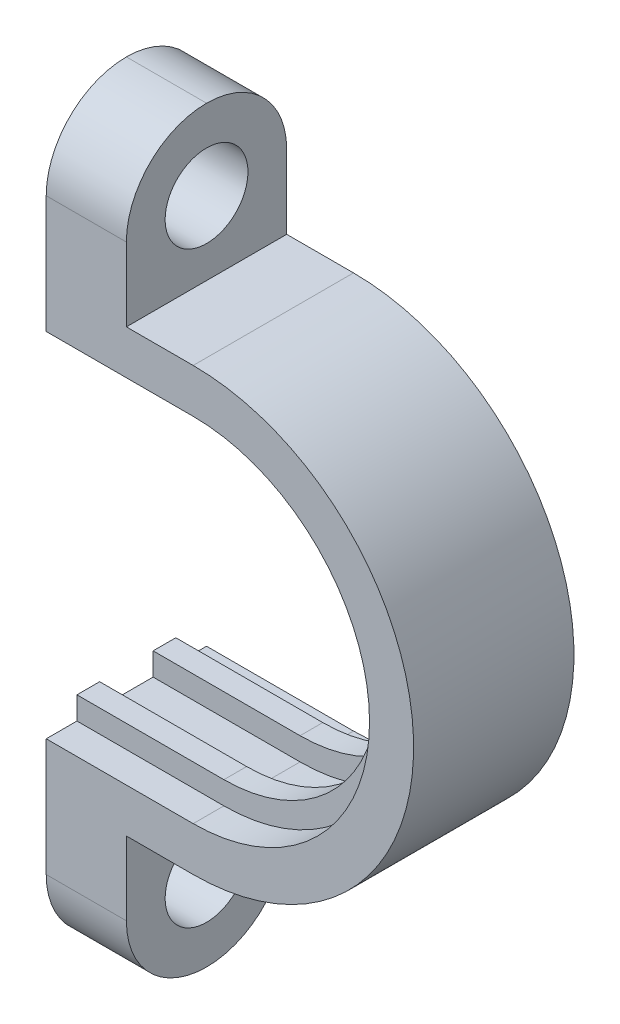
ISO-10303-21;
HEADER;
FILE_DESCRIPTION(('STEP AP214'),'2;1');
FILE_NAME('part.step','',(''),(''),'','','');
FILE_SCHEMA(('AUTOMOTIVE_DESIGN { 1 0 10303 214 1 1 1 1 }'));
ENDSEC;
DATA;
#1=APPLICATION_CONTEXT('core data for automotive mechanical design processes');
#2=APPLICATION_PROTOCOL_DEFINITION('international standard','automotive_design',2000,#1);
#3=PRODUCT_CONTEXT('',#1,'mechanical');
#4=PRODUCT('Part','Part','',(#3));
#5=PRODUCT_RELATED_PRODUCT_CATEGORY('part','',(#4));
#6=PRODUCT_DEFINITION_FORMATION('','',#4);
#7=PRODUCT_DEFINITION_CONTEXT('part definition',#1,'design');
#8=PRODUCT_DEFINITION('design','',#6,#7);
#9=PRODUCT_DEFINITION_SHAPE('','',#8);
#10=(LENGTH_UNIT() NAMED_UNIT(*) SI_UNIT(.MILLI.,.METRE.));
#11=(NAMED_UNIT(*) PLANE_ANGLE_UNIT() SI_UNIT($,.RADIAN.));
#12=(NAMED_UNIT(*) SI_UNIT($,.STERADIAN.) SOLID_ANGLE_UNIT());
#13=UNCERTAINTY_MEASURE_WITH_UNIT(LENGTH_MEASURE(1.E-05),#10,'distance_accuracy_value','');
#14=(GEOMETRIC_REPRESENTATION_CONTEXT(3) GLOBAL_UNCERTAINTY_ASSIGNED_CONTEXT((#13)) GLOBAL_UNIT_ASSIGNED_CONTEXT((#10,
#11,#12)) REPRESENTATION_CONTEXT('',''));
#15=CARTESIAN_POINT('',(0.,0.,0.));
#16=DIRECTION('',(0.,0.,1.));
#17=DIRECTION('',(1.,0.,0.));
#18=AXIS2_PLACEMENT_3D('',#15,#16,#17);
#19=CARTESIAN_POINT('',(0.,0.,6.));
#20=DIRECTION('',(0.,0.,-1.));
#21=DIRECTION('',(-1.,0.,0.));
#22=AXIS2_PLACEMENT_3D('',#19,#20,#21);
#23=CYLINDRICAL_SURFACE('',#22,5.75);
#24=CARTESIAN_POINT('',(0.,0.,4.85));
#25=DIRECTION('',(0.,0.,-1.));
#26=DIRECTION('',(0.,1.,0.));
#27=AXIS2_PLACEMENT_3D('',#24,#25,#26);
#28=CIRCLE('',#27,5.75000000000001);
#29=CARTESIAN_POINT('',(0.,5.75,4.85));
#30=VERTEX_POINT('',#29);
#31=CARTESIAN_POINT('',(0.,-5.75,4.85));
#32=VERTEX_POINT('',#31);
#33=EDGE_CURVE('E469',#30,#32,#28,.T.);
#34=ORIENTED_EDGE('',*,*,#33,.F.);
#35=DIRECTION('',(0.,0.,-1.));
#36=VECTOR('',#35,1.);
#37=CARTESIAN_POINT('',(0.,5.75,6.));
#38=LINE('',#37,#36);
#39=CARTESIAN_POINT('',(0.,5.75,4.));
#40=VERTEX_POINT('',#39);
#41=EDGE_CURVE('E404',#30,#40,#38,.T.);
#42=ORIENTED_EDGE('',*,*,#41,.T.);
#43=CARTESIAN_POINT('',(0.,0.,4.));
#44=DIRECTION('',(0.,0.,-1.));
#45=DIRECTION('',(0.,1.,0.));
#46=AXIS2_PLACEMENT_3D('',#43,#44,#45);
#47=CIRCLE('',#46,5.75);
#48=CARTESIAN_POINT('',(0.,-5.75,4.));
#49=VERTEX_POINT('',#48);
#50=EDGE_CURVE('E246',#40,#49,#47,.T.);
#51=ORIENTED_EDGE('',*,*,#50,.T.);
#52=DIRECTION('',(0.,0.,-1.));
#53=VECTOR('',#52,1.);
#54=CARTESIAN_POINT('',(0.,-5.75,6.));
#55=LINE('',#54,#53);
#56=EDGE_CURVE('E400',#32,#49,#55,.T.);
#57=ORIENTED_EDGE('',*,*,#56,.F.);
#58=EDGE_LOOP('',(#34,#42,#51,#57));
#59=FACE_BOUND('',#58,.T.);
#60=ADVANCED_FACE('F39',(#59),#23,.F.);
#61=CARTESIAN_POINT('',(0.,0.,2.));
#62=DIRECTION('',(0.,0.,-1.));
#63=DIRECTION('',(0.,1.,0.));
#64=AXIS2_PLACEMENT_3D('',#61,#62,#63);
#65=CIRCLE('',#64,5.75);
#66=CARTESIAN_POINT('',(0.,5.75,2.));
#67=VERTEX_POINT('',#66);
#68=CARTESIAN_POINT('',(0.,-5.75,2.));
#69=VERTEX_POINT('',#68);
#70=EDGE_CURVE('E476',#67,#69,#65,.T.);
#71=ORIENTED_EDGE('',*,*,#70,.F.);
#72=CARTESIAN_POINT('',(0.,5.75,1.15));
#73=VERTEX_POINT('',#72);
#74=EDGE_CURVE('E401',#67,#73,#38,.T.);
#75=ORIENTED_EDGE('',*,*,#74,.T.);
#76=CARTESIAN_POINT('',(0.,0.,1.15));
#77=DIRECTION('',(0.,0.,-1.));
#78=DIRECTION('',(0.,1.,0.));
#79=AXIS2_PLACEMENT_3D('',#76,#77,#78);
#80=CIRCLE('',#79,5.75);
#81=CARTESIAN_POINT('',(0.,-5.75,1.15));
#82=VERTEX_POINT('',#81);
#83=EDGE_CURVE('E481',#73,#82,#80,.T.);
#84=ORIENTED_EDGE('',*,*,#83,.T.);
#85=EDGE_CURVE('E397',#69,#82,#55,.T.);
#86=ORIENTED_EDGE('',*,*,#85,.F.);
#87=EDGE_LOOP('',(#71,#75,#84,#86));
#88=FACE_BOUND('',#87,.T.);
#89=ADVANCED_FACE('F497',(#88),#23,.F.);
#90=CARTESIAN_POINT('',(0.,0.,6.));
#91=DIRECTION('',(0.,0.,-1.));
#92=DIRECTION('',(-1.,0.,0.));
#93=AXIS2_PLACEMENT_3D('',#90,#91,#92);
#94=PLANE('',#93);
#95=CARTESIAN_POINT('',(0.,0.,6.));
#96=DIRECTION('',(0.,0.,-1.));
#97=DIRECTION('',(0.,1.,0.));
#98=AXIS2_PLACEMENT_3D('',#95,#96,#97);
#99=CIRCLE('',#98,6.6);
#100=CARTESIAN_POINT('',(0.,6.6,6.));
#101=VERTEX_POINT('',#100);
#102=CARTESIAN_POINT('',(0.,-6.6,6.));
#103=VERTEX_POINT('',#102);
#104=EDGE_CURVE('E318',#101,#103,#99,.T.);
#105=ORIENTED_EDGE('',*,*,#104,.T.);
#106=DIRECTION('',(-1.,0.,0.));
#107=VECTOR('',#106,1.);
#108=CARTESIAN_POINT('',(0.,-6.6,6.));
#109=LINE('',#108,#107);
#110=CARTESIAN_POINT('',(-5.5,-6.6,6.));
#111=VERTEX_POINT('',#110);
#112=EDGE_CURVE('E11',#103,#111,#109,.T.);
#113=ORIENTED_EDGE('',*,*,#112,.T.);
#114=DIRECTION('',(0.,-1.,0.));
#115=VECTOR('',#114,1.);
#116=CARTESIAN_POINT('',(-5.5,-5.75,6.));
#117=LINE('',#116,#115);
#118=CARTESIAN_POINT('',(-5.5,-11.,6.));
#119=VERTEX_POINT('',#118);
#120=EDGE_CURVE('E354',#111,#119,#117,.T.);
#121=ORIENTED_EDGE('',*,*,#120,.T.);
#122=DIRECTION('',(1.,0.,0.));
#123=VECTOR('',#122,1.);
#124=CARTESIAN_POINT('',(0.,-11.,6.));
#125=LINE('',#124,#123);
#126=CARTESIAN_POINT('',(-2.5,-11.,6.));
#127=VERTEX_POINT('',#126);
#128=EDGE_CURVE('E426',#119,#127,#125,.T.);
#129=ORIENTED_EDGE('',*,*,#128,.T.);
#130=DIRECTION('',(0.,1.,0.));
#131=VECTOR('',#130,1.);
#132=CARTESIAN_POINT('',(-2.5,-8.25,6.));
#133=LINE('',#132,#131);
#134=CARTESIAN_POINT('',(-2.5,-8.25,6.));
#135=VERTEX_POINT('',#134);
#136=EDGE_CURVE('E357',#127,#135,#133,.T.);
#137=ORIENTED_EDGE('',*,*,#136,.T.);
#138=DIRECTION('',(1.,0.,0.));
#139=VECTOR('',#138,1.);
#140=CARTESIAN_POINT('',(-2.5,-8.25,6.));
#141=LINE('',#140,#139);
#142=CARTESIAN_POINT('',(0.,-8.25,6.));
#143=VERTEX_POINT('',#142);
#144=EDGE_CURVE('E359',#135,#143,#141,.T.);
#145=ORIENTED_EDGE('',*,*,#144,.T.);
#146=CARTESIAN_POINT('',(0.,0.,6.));
#147=DIRECTION('',(0.,0.,1.));
#148=DIRECTION('',(1.,0.,0.));
#149=AXIS2_PLACEMENT_3D('',#146,#147,#148);
#150=CIRCLE('',#149,8.25);
#151=CARTESIAN_POINT('',(0.,8.25,6.));
#152=VERTEX_POINT('',#151);
#153=EDGE_CURVE('E361',#143,#152,#150,.T.);
#154=ORIENTED_EDGE('',*,*,#153,.T.);
#155=DIRECTION('',(-1.,0.,0.));
#156=VECTOR('',#155,1.);
#157=CARTESIAN_POINT('',(-2.5,8.25,6.));
#158=LINE('',#157,#156);
#159=CARTESIAN_POINT('',(-2.5,8.25,6.));
#160=VERTEX_POINT('',#159);
#161=EDGE_CURVE('E363',#152,#160,#158,.T.);
#162=ORIENTED_EDGE('',*,*,#161,.T.);
#163=DIRECTION('',(0.,1.,0.));
#164=VECTOR('',#163,1.);
#165=CARTESIAN_POINT('',(-2.5,14.,6.));
#166=LINE('',#165,#164);
#167=CARTESIAN_POINT('',(-2.5,11.,6.));
#168=VERTEX_POINT('',#167);
#169=EDGE_CURVE('E365',#160,#168,#166,.T.);
#170=ORIENTED_EDGE('',*,*,#169,.T.);
#171=DIRECTION('',(-1.,0.,0.));
#172=VECTOR('',#171,1.);
#173=CARTESIAN_POINT('',(0.,11.,6.));
#174=LINE('',#173,#172);
#175=CARTESIAN_POINT('',(-5.5,11.,6.));
#176=VERTEX_POINT('',#175);
#177=EDGE_CURVE('E424',#168,#176,#174,.T.);
#178=ORIENTED_EDGE('',*,*,#177,.T.);
#179=DIRECTION('',(0.,-1.,0.));
#180=VECTOR('',#179,1.);
#181=CARTESIAN_POINT('',(-5.5,14.,6.));
#182=LINE('',#181,#180);
#183=CARTESIAN_POINT('',(-5.5,6.6,6.));
#184=VERTEX_POINT('',#183);
#185=EDGE_CURVE('E351',#176,#184,#182,.T.);
#186=ORIENTED_EDGE('',*,*,#185,.T.);
#187=DIRECTION('',(1.,0.,0.));
#188=VECTOR('',#187,1.);
#189=CARTESIAN_POINT('',(0.,6.6,6.));
#190=LINE('',#189,#188);
#191=EDGE_CURVE('E47',#184,#101,#190,.T.);
#192=ORIENTED_EDGE('',*,*,#191,.T.);
#193=EDGE_LOOP('',(#105,#113,#121,#129,#137,#145,#154,#162,#170,#178,#186,#192));
#194=FACE_BOUND('',#193,.T.);
#195=ADVANCED_FACE('F446',(#194),#94,.F.);
#196=CARTESIAN_POINT('',(0.,0.,0.));
#197=DIRECTION('',(0.,0.,-1.));
#198=DIRECTION('',(-1.,0.,0.));
#199=AXIS2_PLACEMENT_3D('',#196,#197,#198);
#200=PLANE('',#199);
#201=DIRECTION('',(-1.,0.,0.));
#202=VECTOR('',#201,1.);
#203=CARTESIAN_POINT('',(0.,-6.6,0.));
#204=LINE('',#203,#202);
#205=CARTESIAN_POINT('',(0.,-6.6,0.));
#206=VERTEX_POINT('',#205);
#207=CARTESIAN_POINT('',(-5.5,-6.6,0.));
#208=VERTEX_POINT('',#207);
#209=EDGE_CURVE('E442',#206,#208,#204,.T.);
#210=ORIENTED_EDGE('',*,*,#209,.F.);
#211=CARTESIAN_POINT('',(0.,0.,0.));
#212=DIRECTION('',(0.,0.,-1.));
#213=DIRECTION('',(0.,1.,0.));
#214=AXIS2_PLACEMENT_3D('',#211,#212,#213);
#215=CIRCLE('',#214,6.6);
#216=CARTESIAN_POINT('',(0.,6.6,0.));
#217=VERTEX_POINT('',#216);
#218=EDGE_CURVE('E247',#217,#206,#215,.T.);
#219=ORIENTED_EDGE('',*,*,#218,.F.);
#220=DIRECTION('',(1.,0.,0.));
#221=VECTOR('',#220,1.);
#222=CARTESIAN_POINT('',(0.,6.6,0.));
#223=LINE('',#222,#221);
#224=CARTESIAN_POINT('',(-5.5,6.6,0.));
#225=VERTEX_POINT('',#224);
#226=EDGE_CURVE('E435',#225,#217,#223,.T.);
#227=ORIENTED_EDGE('',*,*,#226,.F.);
#228=DIRECTION('',(0.,-1.,0.));
#229=VECTOR('',#228,1.);
#230=CARTESIAN_POINT('',(-5.5,14.,0.));
#231=LINE('',#230,#229);
#232=CARTESIAN_POINT('',(-5.5,11.,0.));
#233=VERTEX_POINT('',#232);
#234=EDGE_CURVE('E350',#233,#225,#231,.T.);
#235=ORIENTED_EDGE('',*,*,#234,.F.);
#236=DIRECTION('',(-1.,0.,0.));
#237=VECTOR('',#236,1.);
#238=CARTESIAN_POINT('',(-2.5,11.,0.));
#239=LINE('',#238,#237);
#240=CARTESIAN_POINT('',(-2.5,11.,0.));
#241=VERTEX_POINT('',#240);
#242=EDGE_CURVE('E413',#233,#241,#239,.F.);
#243=ORIENTED_EDGE('',*,*,#242,.T.);
#244=DIRECTION('',(0.,1.,0.));
#245=VECTOR('',#244,1.);
#246=CARTESIAN_POINT('',(-2.5,14.,0.));
#247=LINE('',#246,#245);
#248=CARTESIAN_POINT('',(-2.5,8.25,0.));
#249=VERTEX_POINT('',#248);
#250=EDGE_CURVE('E355',#249,#241,#247,.T.);
#251=ORIENTED_EDGE('',*,*,#250,.F.);
#252=DIRECTION('',(-1.,0.,0.));
#253=VECTOR('',#252,1.);
#254=CARTESIAN_POINT('',(-2.5,8.25,0.));
#255=LINE('',#254,#253);
#256=CARTESIAN_POINT('',(0.,8.25,0.));
#257=VERTEX_POINT('',#256);
#258=EDGE_CURVE('E379',#257,#249,#255,.T.);
#259=ORIENTED_EDGE('',*,*,#258,.F.);
#260=CARTESIAN_POINT('',(0.,0.,0.));
#261=DIRECTION('',(0.,0.,1.));
#262=DIRECTION('',(1.,0.,0.));
#263=AXIS2_PLACEMENT_3D('',#260,#261,#262);
#264=CIRCLE('',#263,8.25);
#265=CARTESIAN_POINT('',(0.,-8.25,0.));
#266=VERTEX_POINT('',#265);
#267=EDGE_CURVE('E377',#266,#257,#264,.T.);
#268=ORIENTED_EDGE('',*,*,#267,.F.);
#269=DIRECTION('',(1.,0.,0.));
#270=VECTOR('',#269,1.);
#271=CARTESIAN_POINT('',(-2.5,-8.25,0.));
#272=LINE('',#271,#270);
#273=CARTESIAN_POINT('',(-2.5,-8.25,0.));
#274=VERTEX_POINT('',#273);
#275=EDGE_CURVE('E375',#274,#266,#272,.T.);
#276=ORIENTED_EDGE('',*,*,#275,.F.);
#277=DIRECTION('',(0.,1.,0.));
#278=VECTOR('',#277,1.);
#279=CARTESIAN_POINT('',(-2.5,-8.25,0.));
#280=LINE('',#279,#278);
#281=CARTESIAN_POINT('',(-2.5,-11.,0.));
#282=VERTEX_POINT('',#281);
#283=EDGE_CURVE('E373',#282,#274,#280,.T.);
#284=ORIENTED_EDGE('',*,*,#283,.F.);
#285=DIRECTION('',(1.,0.,0.));
#286=VECTOR('',#285,1.);
#287=CARTESIAN_POINT('',(-5.5,-11.,0.));
#288=LINE('',#287,#286);
#289=CARTESIAN_POINT('',(-5.5,-11.,0.));
#290=VERTEX_POINT('',#289);
#291=EDGE_CURVE('E416',#282,#290,#288,.F.);
#292=ORIENTED_EDGE('',*,*,#291,.T.);
#293=DIRECTION('',(0.,-1.,0.));
#294=VECTOR('',#293,1.);
#295=CARTESIAN_POINT('',(-5.5,-5.75,0.));
#296=LINE('',#295,#294);
#297=EDGE_CURVE('E371',#208,#290,#296,.T.);
#298=ORIENTED_EDGE('',*,*,#297,.F.);
#299=EDGE_LOOP('',(#210,#219,#227,#235,#243,#251,#259,#268,#276,#284,#292,#298));
#300=FACE_BOUND('',#299,.T.);
#301=ADVANCED_FACE('F537',(#300),#200,.T.);
#302=CARTESIAN_POINT('',(0.,5.75,6.));
#303=DIRECTION('',(0.,1.,0.));
#304=DIRECTION('',(-1.,0.,0.));
#305=AXIS2_PLACEMENT_3D('',#302,#303,#304);
#306=PLANE('',#305);
#307=ORIENTED_EDGE('',*,*,#74,.F.);
#308=DIRECTION('',(-1.,0.,0.));
#309=VECTOR('',#308,1.);
#310=CARTESIAN_POINT('',(0.,5.75,2.));
#311=LINE('',#310,#309);
#312=CARTESIAN_POINT('',(-5.5,5.75,2.));
#313=VERTEX_POINT('',#312);
#314=EDGE_CURVE('E264',#67,#313,#311,.T.);
#315=ORIENTED_EDGE('',*,*,#314,.T.);
#316=DIRECTION('',(0.,0.,-1.));
#317=VECTOR('',#316,1.);
#318=CARTESIAN_POINT('',(-5.5,5.75,6.));
#319=LINE('',#318,#317);
#320=CARTESIAN_POINT('',(-5.5,5.75,1.15));
#321=VERTEX_POINT('',#320);
#322=EDGE_CURVE('E405',#313,#321,#319,.T.);
#323=ORIENTED_EDGE('',*,*,#322,.T.);
#324=DIRECTION('',(-1.,0.,0.));
#325=VECTOR('',#324,1.);
#326=CARTESIAN_POINT('',(0.,5.75,1.15));
#327=LINE('',#326,#325);
#328=EDGE_CURVE('E327',#73,#321,#327,.T.);
#329=ORIENTED_EDGE('',*,*,#328,.F.);
#330=EDGE_LOOP('',(#307,#315,#323,#329));
#331=FACE_BOUND('',#330,.T.);
#332=ADVANCED_FACE('F495',(#331),#306,.F.);
#333=CARTESIAN_POINT('',(0.,-5.75,6.));
#334=DIRECTION('',(0.,-1.,0.));
#335=DIRECTION('',(1.,0.,0.));
#336=AXIS2_PLACEMENT_3D('',#333,#334,#335);
#337=PLANE('',#336);
#338=ORIENTED_EDGE('',*,*,#85,.T.);
#339=DIRECTION('',(-1.,0.,0.));
#340=VECTOR('',#339,1.);
#341=CARTESIAN_POINT('',(0.,-5.75,1.15));
#342=LINE('',#341,#340);
#343=CARTESIAN_POINT('',(-5.5,-5.75,1.15));
#344=VERTEX_POINT('',#343);
#345=EDGE_CURVE('E316',#82,#344,#342,.T.);
#346=ORIENTED_EDGE('',*,*,#345,.T.);
#347=DIRECTION('',(0.,0.,-1.));
#348=VECTOR('',#347,1.);
#349=CARTESIAN_POINT('',(-5.5,-5.75,6.));
#350=LINE('',#349,#348);
#351=CARTESIAN_POINT('',(-5.5,-5.75,2.));
#352=VERTEX_POINT('',#351);
#353=EDGE_CURVE('E393',#352,#344,#350,.T.);
#354=ORIENTED_EDGE('',*,*,#353,.F.);
#355=DIRECTION('',(-1.,0.,0.));
#356=VECTOR('',#355,1.);
#357=CARTESIAN_POINT('',(0.,-5.75,2.));
#358=LINE('',#357,#356);
#359=EDGE_CURVE('E301',#69,#352,#358,.T.);
#360=ORIENTED_EDGE('',*,*,#359,.F.);
#361=EDGE_LOOP('',(#338,#346,#354,#360));
#362=FACE_BOUND('',#361,.T.);
#363=ADVANCED_FACE('F503',(#362),#337,.F.);
#364=CARTESIAN_POINT('',(-5.5,14.,6.));
#365=DIRECTION('',(1.,0.,0.));
#366=DIRECTION('',(0.,1.,0.));
#367=AXIS2_PLACEMENT_3D('',#364,#365,#366);
#368=PLANE('',#367);
#369=CARTESIAN_POINT('',(-5.5,11.,3.));
#370=DIRECTION('',(1.,0.,0.));
#371=DIRECTION('',(0.,1.,0.));
#372=AXIS2_PLACEMENT_3D('',#369,#370,#371);
#373=CIRCLE('',#372,1.55);
#374=CARTESIAN_POINT('',(-5.5,12.55,3.));
#375=VERTEX_POINT('',#374);
#376=EDGE_CURVE('E340',#375,#375,#373,.T.);
#377=ORIENTED_EDGE('',*,*,#376,.T.);
#378=EDGE_LOOP('',(#377));
#379=FACE_BOUND('',#378,.T.);
#380=CARTESIAN_POINT('',(-5.5,5.75,4.85));
#381=VERTEX_POINT('',#380);
#382=CARTESIAN_POINT('',(-5.5,5.75,4.));
#383=VERTEX_POINT('',#382);
#384=EDGE_CURVE('E408',#381,#383,#319,.T.);
#385=ORIENTED_EDGE('',*,*,#384,.F.);
#386=DIRECTION('',(0.,-1.,0.));
#387=VECTOR('',#386,1.);
#388=CARTESIAN_POINT('',(-5.5,5.75,4.85));
#389=LINE('',#388,#387);
#390=CARTESIAN_POINT('',(-5.5,6.6,4.85));
#391=VERTEX_POINT('',#390);
#392=EDGE_CURVE('E281',#391,#381,#389,.T.);
#393=ORIENTED_EDGE('',*,*,#392,.F.);
#394=DIRECTION('',(0.,0.,-1.));
#395=VECTOR('',#394,1.);
#396=CARTESIAN_POINT('',(-5.5,6.6,4.85));
#397=LINE('',#396,#395);
#398=EDGE_CURVE('E279',#184,#391,#397,.T.);
#399=ORIENTED_EDGE('',*,*,#398,.F.);
#400=ORIENTED_EDGE('',*,*,#185,.F.);
#401=CARTESIAN_POINT('',(-5.5,11.,3.));
#402=DIRECTION('',(1.,0.,0.));
#403=DIRECTION('',(0.,1.,0.));
#404=AXIS2_PLACEMENT_3D('',#401,#402,#403);
#405=CIRCLE('',#404,3.);
#406=CARTESIAN_POINT('',(-5.5,14.,3.));
#407=VERTEX_POINT('',#406);
#408=EDGE_CURVE('E428',#176,#407,#405,.F.);
#409=ORIENTED_EDGE('',*,*,#408,.T.);
#410=CARTESIAN_POINT('',(-5.5,11.,3.));
#411=DIRECTION('',(1.,0.,0.));
#412=DIRECTION('',(0.,1.,0.));
#413=AXIS2_PLACEMENT_3D('',#410,#411,#412);
#414=CIRCLE('',#413,3.);
#415=EDGE_CURVE('E430',#407,#233,#414,.F.);
#416=ORIENTED_EDGE('',*,*,#415,.T.);
#417=ORIENTED_EDGE('',*,*,#234,.T.);
#418=DIRECTION('',(0.,0.,-1.));
#419=VECTOR('',#418,1.);
#420=CARTESIAN_POINT('',(-5.5,6.6,-0.85));
#421=LINE('',#420,#419);
#422=CARTESIAN_POINT('',(-5.5,6.6,1.15));
#423=VERTEX_POINT('',#422);
#424=EDGE_CURVE('E328',#423,#225,#421,.T.);
#425=ORIENTED_EDGE('',*,*,#424,.F.);
#426=DIRECTION('',(0.,1.,0.));
#427=VECTOR('',#426,1.);
#428=CARTESIAN_POINT('',(-5.5,5.75,1.15));
#429=LINE('',#428,#427);
#430=EDGE_CURVE('E329',#321,#423,#429,.T.);
#431=ORIENTED_EDGE('',*,*,#430,.F.);
#432=ORIENTED_EDGE('',*,*,#322,.F.);
#433=DIRECTION('',(0.,-1.,0.));
#434=VECTOR('',#433,1.);
#435=CARTESIAN_POINT('',(-5.5,5.75,2.));
#436=LINE('',#435,#434);
#437=CARTESIAN_POINT('',(-5.5,6.6,2.));
#438=VERTEX_POINT('',#437);
#439=EDGE_CURVE('E270',#438,#313,#436,.T.);
#440=ORIENTED_EDGE('',*,*,#439,.F.);
#441=DIRECTION('',(0.,0.,-1.));
#442=VECTOR('',#441,1.);
#443=CARTESIAN_POINT('',(-5.5,6.6,2.));
#444=LINE('',#443,#442);
#445=CARTESIAN_POINT('',(-5.5,6.6,4.));
#446=VERTEX_POINT('',#445);
#447=EDGE_CURVE('E263',#446,#438,#444,.T.);
#448=ORIENTED_EDGE('',*,*,#447,.F.);
#449=DIRECTION('',(0.,1.,0.));
#450=VECTOR('',#449,1.);
#451=CARTESIAN_POINT('',(-5.5,5.75,4.));
#452=LINE('',#451,#450);
#453=EDGE_CURVE('E254',#383,#446,#452,.T.);
#454=ORIENTED_EDGE('',*,*,#453,.F.);
#455=EDGE_LOOP('',(#385,#393,#399,#400,#409,#416,#417,#425,#431,#432,#440,#448,#454));
#456=FACE_BOUND('',#455,.T.);
#457=ADVANCED_FACE('F457',(#379,#456),#368,.F.);
#458=ORIENTED_EDGE('',*,*,#41,.F.);
#459=DIRECTION('',(-1.,0.,0.));
#460=VECTOR('',#459,1.);
#461=CARTESIAN_POINT('',(0.,5.75,4.85));
#462=LINE('',#461,#460);
#463=EDGE_CURVE('E272',#30,#381,#462,.T.);
#464=ORIENTED_EDGE('',*,*,#463,.T.);
#465=ORIENTED_EDGE('',*,*,#384,.T.);
#466=DIRECTION('',(-1.,0.,0.));
#467=VECTOR('',#466,1.);
#468=CARTESIAN_POINT('',(0.,5.75,4.));
#469=LINE('',#468,#467);
#470=EDGE_CURVE('E258',#40,#383,#469,.T.);
#471=ORIENTED_EDGE('',*,*,#470,.F.);
#472=EDGE_LOOP('',(#458,#464,#465,#471));
#473=FACE_BOUND('',#472,.T.);
#474=ADVANCED_FACE('F525',(#473),#306,.F.);
#475=ORIENTED_EDGE('',*,*,#56,.T.);
#476=DIRECTION('',(-1.,0.,0.));
#477=VECTOR('',#476,1.);
#478=CARTESIAN_POINT('',(0.,-5.75,4.));
#479=LINE('',#478,#477);
#480=CARTESIAN_POINT('',(-5.5,-5.75,4.));
#481=VERTEX_POINT('',#480);
#482=EDGE_CURVE('E299',#49,#481,#479,.T.);
#483=ORIENTED_EDGE('',*,*,#482,.T.);
#484=CARTESIAN_POINT('',(-5.5,-5.75000000000001,4.85));
#485=VERTEX_POINT('',#484);
#486=EDGE_CURVE('E396',#485,#481,#350,.T.);
#487=ORIENTED_EDGE('',*,*,#486,.F.);
#488=DIRECTION('',(-1.,0.,0.));
#489=VECTOR('',#488,1.);
#490=CARTESIAN_POINT('',(0.,-5.75,4.85));
#491=LINE('',#490,#489);
#492=EDGE_CURVE('E288',#32,#485,#491,.T.);
#493=ORIENTED_EDGE('',*,*,#492,.F.);
#494=EDGE_LOOP('',(#475,#483,#487,#493));
#495=FACE_BOUND('',#494,.T.);
#496=ADVANCED_FACE('F519',(#495),#337,.F.);
#497=CARTESIAN_POINT('',(-5.5,-5.75,6.));
#498=DIRECTION('',(1.,0.,0.));
#499=DIRECTION('',(0.,1.,0.));
#500=AXIS2_PLACEMENT_3D('',#497,#498,#499);
#501=PLANE('',#500);
#502=CARTESIAN_POINT('',(-5.5,-11.,3.));
#503=DIRECTION('',(1.,0.,0.));
#504=DIRECTION('',(0.,1.,0.));
#505=AXIS2_PLACEMENT_3D('',#502,#503,#504);
#506=CIRCLE('',#505,1.55);
#507=CARTESIAN_POINT('',(-5.5,-9.45,3.));
#508=VERTEX_POINT('',#507);
#509=EDGE_CURVE('E347',#508,#508,#506,.T.);
#510=ORIENTED_EDGE('',*,*,#509,.T.);
#511=EDGE_LOOP('',(#510));
#512=FACE_BOUND('',#511,.T.);
#513=ORIENTED_EDGE('',*,*,#353,.T.);
#514=DIRECTION('',(0.,1.,0.));
#515=VECTOR('',#514,1.);
#516=CARTESIAN_POINT('',(-5.5,-5.75,1.15));
#517=LINE('',#516,#515);
#518=CARTESIAN_POINT('',(-5.5,-6.6,1.15));
#519=VERTEX_POINT('',#518);
#520=EDGE_CURVE('E319',#519,#344,#517,.T.);
#521=ORIENTED_EDGE('',*,*,#520,.F.);
#522=DIRECTION('',(0.,0.,1.));
#523=VECTOR('',#522,1.);
#524=CARTESIAN_POINT('',(-5.5,-6.6,-0.85));
#525=LINE('',#524,#523);
#526=EDGE_CURVE('E303',#208,#519,#525,.T.);
#527=ORIENTED_EDGE('',*,*,#526,.F.);
#528=ORIENTED_EDGE('',*,*,#297,.T.);
#529=CARTESIAN_POINT('',(-5.5,-11.,3.));
#530=DIRECTION('',(1.,0.,0.));
#531=DIRECTION('',(0.,1.,0.));
#532=AXIS2_PLACEMENT_3D('',#529,#530,#531);
#533=CIRCLE('',#532,3.);
#534=CARTESIAN_POINT('',(-5.5,-14.,3.));
#535=VERTEX_POINT('',#534);
#536=EDGE_CURVE('E422',#290,#535,#533,.F.);
#537=ORIENTED_EDGE('',*,*,#536,.T.);
#538=CARTESIAN_POINT('',(-5.5,-11.,3.));
#539=DIRECTION('',(1.,0.,0.));
#540=DIRECTION('',(0.,1.,0.));
#541=AXIS2_PLACEMENT_3D('',#538,#539,#540);
#542=CIRCLE('',#541,3.);
#543=EDGE_CURVE('E419',#535,#119,#542,.F.);
#544=ORIENTED_EDGE('',*,*,#543,.T.);
#545=ORIENTED_EDGE('',*,*,#120,.F.);
#546=DIRECTION('',(0.,0.,1.));
#547=VECTOR('',#546,1.);
#548=CARTESIAN_POINT('',(-5.5,-6.6,4.85));
#549=LINE('',#548,#547);
#550=CARTESIAN_POINT('',(-5.5,-6.6,4.85));
#551=VERTEX_POINT('',#550);
#552=EDGE_CURVE('E290',#551,#111,#549,.T.);
#553=ORIENTED_EDGE('',*,*,#552,.F.);
#554=DIRECTION('',(0.,-1.,0.));
#555=VECTOR('',#554,1.);
#556=CARTESIAN_POINT('',(-5.5,-5.75000000000001,4.85));
#557=LINE('',#556,#555);
#558=EDGE_CURVE('E278',#485,#551,#557,.T.);
#559=ORIENTED_EDGE('',*,*,#558,.F.);
#560=ORIENTED_EDGE('',*,*,#486,.T.);
#561=DIRECTION('',(0.,1.,0.));
#562=VECTOR('',#561,1.);
#563=CARTESIAN_POINT('',(-5.5,-5.75,4.));
#564=LINE('',#563,#562);
#565=CARTESIAN_POINT('',(-5.5,-6.6,4.));
#566=VERTEX_POINT('',#565);
#567=EDGE_CURVE('E304',#566,#481,#564,.T.);
#568=ORIENTED_EDGE('',*,*,#567,.F.);
#569=DIRECTION('',(0.,0.,1.));
#570=VECTOR('',#569,1.);
#571=CARTESIAN_POINT('',(-5.5,-6.6,2.));
#572=LINE('',#571,#570);
#573=CARTESIAN_POINT('',(-5.5,-6.6,2.));
#574=VERTEX_POINT('',#573);
#575=EDGE_CURVE('E307',#574,#566,#572,.T.);
#576=ORIENTED_EDGE('',*,*,#575,.F.);
#577=DIRECTION('',(0.,-1.,0.));
#578=VECTOR('',#577,1.);
#579=CARTESIAN_POINT('',(-5.5,-5.75,2.));
#580=LINE('',#579,#578);
#581=EDGE_CURVE('E54',#352,#574,#580,.T.);
#582=ORIENTED_EDGE('',*,*,#581,.F.);
#583=EDGE_LOOP('',(#513,#521,#527,#528,#537,#544,#545,#553,#559,#560,#568,#576,#582));
#584=FACE_BOUND('',#583,.T.);
#585=ADVANCED_FACE('F506',(#512,#584),#501,.F.);
#586=CARTESIAN_POINT('',(-2.5,-8.25,6.));
#587=DIRECTION('',(-1.,0.,0.));
#588=DIRECTION('',(0.,-1.,0.));
#589=AXIS2_PLACEMENT_3D('',#586,#587,#588);
#590=PLANE('',#589);
#591=CARTESIAN_POINT('',(-2.49999999999999,-11.,3.));
#592=DIRECTION('',(1.,0.,0.));
#593=DIRECTION('',(0.,1.,0.));
#594=AXIS2_PLACEMENT_3D('',#591,#592,#593);
#595=CIRCLE('',#594,1.55);
#596=CARTESIAN_POINT('',(-2.49999999999999,-9.45,3.));
#597=VERTEX_POINT('',#596);
#598=EDGE_CURVE('E337',#597,#597,#595,.T.);
#599=ORIENTED_EDGE('',*,*,#598,.F.);
#600=EDGE_LOOP('',(#599));
#601=FACE_BOUND('',#600,.T.);
#602=CARTESIAN_POINT('',(-2.5,-11.,3.));
#603=DIRECTION('',(-1.,0.,0.));
#604=DIRECTION('',(0.,-1.,0.));
#605=AXIS2_PLACEMENT_3D('',#602,#603,#604);
#606=CIRCLE('',#605,3.);
#607=CARTESIAN_POINT('',(-2.5,-14.,3.));
#608=VERTEX_POINT('',#607);
#609=EDGE_CURVE('E409',#127,#608,#606,.F.);
#610=ORIENTED_EDGE('',*,*,#609,.T.);
#611=CARTESIAN_POINT('',(-2.5,-11.,3.));
#612=DIRECTION('',(-1.,0.,0.));
#613=DIRECTION('',(0.,-1.,0.));
#614=AXIS2_PLACEMENT_3D('',#611,#612,#613);
#615=CIRCLE('',#614,3.);
#616=EDGE_CURVE('E411',#608,#282,#615,.F.);
#617=ORIENTED_EDGE('',*,*,#616,.T.);
#618=ORIENTED_EDGE('',*,*,#283,.T.);
#619=DIRECTION('',(0.,0.,-1.));
#620=VECTOR('',#619,1.);
#621=CARTESIAN_POINT('',(-2.5,-8.25,6.));
#622=LINE('',#621,#620);
#623=EDGE_CURVE('E390',#135,#274,#622,.T.);
#624=ORIENTED_EDGE('',*,*,#623,.F.);
#625=ORIENTED_EDGE('',*,*,#136,.F.);
#626=EDGE_LOOP('',(#610,#617,#618,#624,#625));
#627=FACE_BOUND('',#626,.T.);
#628=ADVANCED_FACE('F545',(#601,#627),#590,.F.);
#629=CARTESIAN_POINT('',(-2.5,-8.25,6.));
#630=DIRECTION('',(0.,1.,0.));
#631=DIRECTION('',(0.,0.,1.));
#632=AXIS2_PLACEMENT_3D('',#629,#630,#631);
#633=PLANE('',#632);
#634=ORIENTED_EDGE('',*,*,#275,.T.);
#635=DIRECTION('',(0.,0.,-1.));
#636=VECTOR('',#635,1.);
#637=CARTESIAN_POINT('',(0.,-8.25,6.));
#638=LINE('',#637,#636);
#639=EDGE_CURVE('E387',#143,#266,#638,.T.);
#640=ORIENTED_EDGE('',*,*,#639,.F.);
#641=ORIENTED_EDGE('',*,*,#144,.F.);
#642=ORIENTED_EDGE('',*,*,#623,.T.);
#643=EDGE_LOOP('',(#634,#640,#641,#642));
#644=FACE_BOUND('',#643,.T.);
#645=ADVANCED_FACE('F549',(#644),#633,.F.);
#646=CARTESIAN_POINT('',(0.,0.,6.));
#647=DIRECTION('',(0.,0.,-1.));
#648=DIRECTION('',(-1.,0.,0.));
#649=AXIS2_PLACEMENT_3D('',#646,#647,#648);
#650=CYLINDRICAL_SURFACE('',#649,8.25);
#651=ORIENTED_EDGE('',*,*,#267,.T.);
#652=DIRECTION('',(0.,0.,-1.));
#653=VECTOR('',#652,1.);
#654=CARTESIAN_POINT('',(0.,8.25,6.));
#655=LINE('',#654,#653);
#656=EDGE_CURVE('E384',#152,#257,#655,.T.);
#657=ORIENTED_EDGE('',*,*,#656,.F.);
#658=ORIENTED_EDGE('',*,*,#153,.F.);
#659=ORIENTED_EDGE('',*,*,#639,.T.);
#660=EDGE_LOOP('',(#651,#657,#658,#659));
#661=FACE_BOUND('',#660,.T.);
#662=ADVANCED_FACE('F553',(#661),#650,.T.);
#663=CARTESIAN_POINT('',(-2.5,8.25,6.));
#664=DIRECTION('',(0.,-1.,0.));
#665=DIRECTION('',(0.,0.,-1.));
#666=AXIS2_PLACEMENT_3D('',#663,#664,#665);
#667=PLANE('',#666);
#668=ORIENTED_EDGE('',*,*,#258,.T.);
#669=DIRECTION('',(0.,0.,-1.));
#670=VECTOR('',#669,1.);
#671=CARTESIAN_POINT('',(-2.5,8.25,6.));
#672=LINE('',#671,#670);
#673=EDGE_CURVE('E368',#160,#249,#672,.T.);
#674=ORIENTED_EDGE('',*,*,#673,.F.);
#675=ORIENTED_EDGE('',*,*,#161,.F.);
#676=ORIENTED_EDGE('',*,*,#656,.T.);
#677=EDGE_LOOP('',(#668,#674,#675,#676));
#678=FACE_BOUND('',#677,.T.);
#679=ADVANCED_FACE('F557',(#678),#667,.F.);
#680=CARTESIAN_POINT('',(-2.5,14.,6.));
#681=DIRECTION('',(-1.,0.,0.));
#682=DIRECTION('',(0.,-1.,0.));
#683=AXIS2_PLACEMENT_3D('',#680,#681,#682);
#684=PLANE('',#683);
#685=CARTESIAN_POINT('',(-2.5,11.,3.));
#686=DIRECTION('',(1.,0.,0.));
#687=DIRECTION('',(0.,1.,0.));
#688=AXIS2_PLACEMENT_3D('',#685,#686,#687);
#689=CIRCLE('',#688,1.55);
#690=CARTESIAN_POINT('',(-2.5,12.55,3.));
#691=VERTEX_POINT('',#690);
#692=EDGE_CURVE('E341',#691,#691,#689,.T.);
#693=ORIENTED_EDGE('',*,*,#692,.F.);
#694=EDGE_LOOP('',(#693));
#695=FACE_BOUND('',#694,.T.);
#696=ORIENTED_EDGE('',*,*,#250,.T.);
#697=CARTESIAN_POINT('',(-2.5,11.,3.));
#698=DIRECTION('',(-1.,0.,0.));
#699=DIRECTION('',(0.,-1.,0.));
#700=AXIS2_PLACEMENT_3D('',#697,#698,#699);
#701=CIRCLE('',#700,3.);
#702=CARTESIAN_POINT('',(-2.5,14.,3.));
#703=VERTEX_POINT('',#702);
#704=EDGE_CURVE('E62',#241,#703,#701,.F.);
#705=ORIENTED_EDGE('',*,*,#704,.T.);
#706=CARTESIAN_POINT('',(-2.5,11.,3.));
#707=DIRECTION('',(-1.,0.,0.));
#708=DIRECTION('',(0.,-1.,0.));
#709=AXIS2_PLACEMENT_3D('',#706,#707,#708);
#710=CIRCLE('',#709,3.);
#711=EDGE_CURVE('E432',#703,#168,#710,.F.);
#712=ORIENTED_EDGE('',*,*,#711,.T.);
#713=ORIENTED_EDGE('',*,*,#169,.F.);
#714=ORIENTED_EDGE('',*,*,#673,.T.);
#715=EDGE_LOOP('',(#696,#705,#712,#713,#714));
#716=FACE_BOUND('',#715,.T.);
#717=ADVANCED_FACE('F561',(#695,#716),#684,.F.);
#718=CARTESIAN_POINT('',(-8.5,11.,3.));
#719=DIRECTION('',(1.,0.,0.));
#720=DIRECTION('',(0.,1.,0.));
#721=AXIS2_PLACEMENT_3D('',#718,#719,#720);
#722=CYLINDRICAL_SURFACE('',#721,1.55);
#723=ORIENTED_EDGE('',*,*,#692,.T.);
#724=EDGE_LOOP('',(#723));
#725=FACE_BOUND('',#724,.T.);
#726=ORIENTED_EDGE('',*,*,#376,.F.);
#727=EDGE_LOOP('',(#726));
#728=FACE_BOUND('',#727,.T.);
#729=ADVANCED_FACE('F565',(#725,#728),#722,.F.);
#730=CARTESIAN_POINT('',(-8.49999999999999,-11.,3.));
#731=DIRECTION('',(1.,0.,0.));
#732=DIRECTION('',(0.,1.,0.));
#733=AXIS2_PLACEMENT_3D('',#730,#731,#732);
#734=CYLINDRICAL_SURFACE('',#733,1.55);
#735=ORIENTED_EDGE('',*,*,#598,.T.);
#736=EDGE_LOOP('',(#735));
#737=FACE_BOUND('',#736,.T.);
#738=ORIENTED_EDGE('',*,*,#509,.F.);
#739=EDGE_LOOP('',(#738));
#740=FACE_BOUND('',#739,.T.);
#741=ADVANCED_FACE('F574',(#737,#740),#734,.F.);
#742=CARTESIAN_POINT('',(0.,-11.,3.));
#743=DIRECTION('',(1.,0.,0.));
#744=DIRECTION('',(0.,0.,-1.));
#745=AXIS2_PLACEMENT_3D('',#742,#743,#744);
#746=CYLINDRICAL_SURFACE('',#745,3.);
#747=ORIENTED_EDGE('',*,*,#128,.F.);
#748=ORIENTED_EDGE('',*,*,#543,.F.);
#749=DIRECTION('',(1.,0.,0.));
#750=VECTOR('',#749,1.);
#751=CARTESIAN_POINT('',(-2.5,-14.,3.));
#752=LINE('',#751,#750);
#753=EDGE_CURVE('E344',#608,#535,#752,.F.);
#754=ORIENTED_EDGE('',*,*,#753,.F.);
#755=ORIENTED_EDGE('',*,*,#609,.F.);
#756=EDGE_LOOP('',(#747,#748,#754,#755));
#757=FACE_BOUND('',#756,.T.);
#758=ADVANCED_FACE('F578',(#757),#746,.T.);
#759=CARTESIAN_POINT('',(-2.5,-11.,3.));
#760=DIRECTION('',(-1.,0.,0.));
#761=DIRECTION('',(0.,0.,1.));
#762=AXIS2_PLACEMENT_3D('',#759,#760,#761);
#763=CYLINDRICAL_SURFACE('',#762,3.);
#764=ORIENTED_EDGE('',*,*,#536,.F.);
#765=ORIENTED_EDGE('',*,*,#291,.F.);
#766=ORIENTED_EDGE('',*,*,#616,.F.);
#767=ORIENTED_EDGE('',*,*,#753,.T.);
#768=EDGE_LOOP('',(#764,#765,#766,#767));
#769=FACE_BOUND('',#768,.T.);
#770=ADVANCED_FACE('F655',(#769),#763,.T.);
#771=CARTESIAN_POINT('',(0.,11.,3.));
#772=DIRECTION('',(-1.,0.,0.));
#773=DIRECTION('',(0.,0.,1.));
#774=AXIS2_PLACEMENT_3D('',#771,#772,#773);
#775=CYLINDRICAL_SURFACE('',#774,3.);
#776=ORIENTED_EDGE('',*,*,#177,.F.);
#777=ORIENTED_EDGE('',*,*,#711,.F.);
#778=DIRECTION('',(-1.,0.,0.));
#779=VECTOR('',#778,1.);
#780=CARTESIAN_POINT('',(-2.5,14.,3.));
#781=LINE('',#780,#779);
#782=EDGE_CURVE('E335',#407,#703,#781,.F.);
#783=ORIENTED_EDGE('',*,*,#782,.F.);
#784=ORIENTED_EDGE('',*,*,#408,.F.);
#785=EDGE_LOOP('',(#776,#777,#783,#784));
#786=FACE_BOUND('',#785,.T.);
#787=ADVANCED_FACE('F41',(#786),#775,.T.);
#788=CARTESIAN_POINT('',(-2.5,11.,3.));
#789=DIRECTION('',(1.,0.,0.));
#790=DIRECTION('',(0.,0.,-1.));
#791=AXIS2_PLACEMENT_3D('',#788,#789,#790);
#792=CYLINDRICAL_SURFACE('',#791,3.);
#793=ORIENTED_EDGE('',*,*,#704,.F.);
#794=ORIENTED_EDGE('',*,*,#242,.F.);
#795=ORIENTED_EDGE('',*,*,#415,.F.);
#796=ORIENTED_EDGE('',*,*,#782,.T.);
#797=EDGE_LOOP('',(#793,#794,#795,#796));
#798=FACE_BOUND('',#797,.T.);
#799=ADVANCED_FACE('F584',(#798),#792,.T.);
#800=CARTESIAN_POINT('',(0.,6.6,-0.85));
#801=DIRECTION('',(0.,1.,0.));
#802=DIRECTION('',(-1.,0.,0.));
#803=AXIS2_PLACEMENT_3D('',#800,#801,#802);
#804=PLANE('',#803);
#805=ORIENTED_EDGE('',*,*,#226,.T.);
#806=DIRECTION('',(0.,0.,-1.));
#807=VECTOR('',#806,1.);
#808=CARTESIAN_POINT('',(0.,6.6,-0.85));
#809=LINE('',#808,#807);
#810=CARTESIAN_POINT('',(0.,6.6,1.15));
#811=VERTEX_POINT('',#810);
#812=EDGE_CURVE('E325',#811,#217,#809,.T.);
#813=ORIENTED_EDGE('',*,*,#812,.F.);
#814=DIRECTION('',(-1.,0.,0.));
#815=VECTOR('',#814,1.);
#816=CARTESIAN_POINT('',(0.,6.6,1.15));
#817=LINE('',#816,#815);
#818=EDGE_CURVE('E333',#811,#423,#817,.T.);
#819=ORIENTED_EDGE('',*,*,#818,.T.);
#820=ORIENTED_EDGE('',*,*,#424,.T.);
#821=EDGE_LOOP('',(#805,#813,#819,#820));
#822=FACE_BOUND('',#821,.T.);
#823=ADVANCED_FACE('F580',(#822),#804,.F.);
#824=CARTESIAN_POINT('',(0.,-5.75,1.15));
#825=DIRECTION('',(0.,0.,1.));
#826=DIRECTION('',(1.,0.,0.));
#827=AXIS2_PLACEMENT_3D('',#824,#825,#826);
#828=PLANE('',#827);
#829=ORIENTED_EDGE('',*,*,#345,.F.);
#830=ORIENTED_EDGE('',*,*,#83,.F.);
#831=ORIENTED_EDGE('',*,*,#328,.T.);
#832=ORIENTED_EDGE('',*,*,#430,.T.);
#833=ORIENTED_EDGE('',*,*,#818,.F.);
#834=CARTESIAN_POINT('',(0.,0.,1.15));
#835=DIRECTION('',(0.,0.,-1.));
#836=DIRECTION('',(0.,1.,0.));
#837=AXIS2_PLACEMENT_3D('',#834,#835,#836);
#838=CIRCLE('',#837,6.6);
#839=CARTESIAN_POINT('',(0.,-6.6,1.15));
#840=VERTEX_POINT('',#839);
#841=EDGE_CURVE('E479',#811,#840,#838,.T.);
#842=ORIENTED_EDGE('',*,*,#841,.T.);
#843=DIRECTION('',(-1.,0.,0.));
#844=VECTOR('',#843,1.);
#845=CARTESIAN_POINT('',(0.,-6.6,1.15));
#846=LINE('',#845,#844);
#847=EDGE_CURVE('E312',#840,#519,#846,.T.);
#848=ORIENTED_EDGE('',*,*,#847,.T.);
#849=ORIENTED_EDGE('',*,*,#520,.T.);
#850=EDGE_LOOP('',(#829,#830,#831,#832,#833,#842,#848,#849));
#851=FACE_BOUND('',#850,.T.);
#852=ADVANCED_FACE('F583',(#851),#828,.F.);
#853=CARTESIAN_POINT('',(0.,-6.6,-0.85));
#854=DIRECTION('',(0.,-1.,0.));
#855=DIRECTION('',(1.,0.,0.));
#856=AXIS2_PLACEMENT_3D('',#853,#854,#855);
#857=PLANE('',#856);
#858=ORIENTED_EDGE('',*,*,#209,.T.);
#859=ORIENTED_EDGE('',*,*,#526,.T.);
#860=ORIENTED_EDGE('',*,*,#847,.F.);
#861=DIRECTION('',(0.,0.,1.));
#862=VECTOR('',#861,1.);
#863=CARTESIAN_POINT('',(0.,-6.6,-0.85));
#864=LINE('',#863,#862);
#865=EDGE_CURVE('E315',#206,#840,#864,.T.);
#866=ORIENTED_EDGE('',*,*,#865,.F.);
#867=EDGE_LOOP('',(#858,#859,#860,#866));
#868=FACE_BOUND('',#867,.T.);
#869=ADVANCED_FACE('F588',(#868),#857,.F.);
#870=CARTESIAN_POINT('',(0.,6.6,4.85));
#871=DIRECTION('',(0.,1.,0.));
#872=DIRECTION('',(-1.,0.,0.));
#873=AXIS2_PLACEMENT_3D('',#870,#871,#872);
#874=PLANE('',#873);
#875=ORIENTED_EDGE('',*,*,#398,.T.);
#876=DIRECTION('',(-1.,0.,0.));
#877=VECTOR('',#876,1.);
#878=CARTESIAN_POINT('',(0.,6.6,4.85));
#879=LINE('',#878,#877);
#880=CARTESIAN_POINT('',(0.,6.6,4.85));
#881=VERTEX_POINT('',#880);
#882=EDGE_CURVE('E275',#881,#391,#879,.T.);
#883=ORIENTED_EDGE('',*,*,#882,.F.);
#884=DIRECTION('',(0.,0.,-1.));
#885=VECTOR('',#884,1.);
#886=CARTESIAN_POINT('',(0.,6.6,4.85));
#887=LINE('',#886,#885);
#888=EDGE_CURVE('E274',#101,#881,#887,.T.);
#889=ORIENTED_EDGE('',*,*,#888,.F.);
#890=ORIENTED_EDGE('',*,*,#191,.F.);
#891=EDGE_LOOP('',(#875,#883,#889,#890));
#892=FACE_BOUND('',#891,.T.);
#893=ADVANCED_FACE('F452',(#892),#874,.F.);
#894=CARTESIAN_POINT('',(0.,-6.6,4.85));
#895=DIRECTION('',(0.,-1.,0.));
#896=DIRECTION('',(1.,0.,0.));
#897=AXIS2_PLACEMENT_3D('',#894,#895,#896);
#898=PLANE('',#897);
#899=DIRECTION('',(0.,0.,1.));
#900=VECTOR('',#899,1.);
#901=CARTESIAN_POINT('',(0.,-6.6,4.85));
#902=LINE('',#901,#900);
#903=CARTESIAN_POINT('',(0.,-6.6,4.85));
#904=VERTEX_POINT('',#903);
#905=EDGE_CURVE('E287',#904,#103,#902,.T.);
#906=ORIENTED_EDGE('',*,*,#905,.F.);
#907=DIRECTION('',(-1.,0.,0.));
#908=VECTOR('',#907,1.);
#909=CARTESIAN_POINT('',(0.,-6.6,4.85));
#910=LINE('',#909,#908);
#911=EDGE_CURVE('E285',#904,#551,#910,.T.);
#912=ORIENTED_EDGE('',*,*,#911,.T.);
#913=ORIENTED_EDGE('',*,*,#552,.T.);
#914=ORIENTED_EDGE('',*,*,#112,.F.);
#915=EDGE_LOOP('',(#906,#912,#913,#914));
#916=FACE_BOUND('',#915,.T.);
#917=ADVANCED_FACE('F599',(#916),#898,.F.);
#918=CARTESIAN_POINT('',(0.,-5.75,4.85));
#919=DIRECTION('',(0.,0.,-1.));
#920=DIRECTION('',(-1.,0.,0.));
#921=AXIS2_PLACEMENT_3D('',#918,#919,#920);
#922=PLANE('',#921);
#923=ORIENTED_EDGE('',*,*,#492,.T.);
#924=ORIENTED_EDGE('',*,*,#558,.T.);
#925=ORIENTED_EDGE('',*,*,#911,.F.);
#926=CARTESIAN_POINT('',(0.,0.,4.85));
#927=DIRECTION('',(0.,0.,-1.));
#928=DIRECTION('',(0.,1.,0.));
#929=AXIS2_PLACEMENT_3D('',#926,#927,#928);
#930=CIRCLE('',#929,6.6);
#931=EDGE_CURVE('E466',#881,#904,#930,.T.);
#932=ORIENTED_EDGE('',*,*,#931,.F.);
#933=ORIENTED_EDGE('',*,*,#882,.T.);
#934=ORIENTED_EDGE('',*,*,#392,.T.);
#935=ORIENTED_EDGE('',*,*,#463,.F.);
#936=ORIENTED_EDGE('',*,*,#33,.T.);
#937=EDGE_LOOP('',(#923,#924,#925,#932,#933,#934,#935,#936));
#938=FACE_BOUND('',#937,.T.);
#939=ADVANCED_FACE('F462',(#938),#922,.F.);
#940=CARTESIAN_POINT('',(0.,-5.75,2.));
#941=DIRECTION('',(0.,0.,-1.));
#942=DIRECTION('',(-1.,0.,0.));
#943=AXIS2_PLACEMENT_3D('',#940,#941,#942);
#944=PLANE('',#943);
#945=ORIENTED_EDGE('',*,*,#359,.T.);
#946=ORIENTED_EDGE('',*,*,#581,.T.);
#947=DIRECTION('',(-1.,0.,0.));
#948=VECTOR('',#947,1.);
#949=CARTESIAN_POINT('',(0.,-6.6,2.));
#950=LINE('',#949,#948);
#951=CARTESIAN_POINT('',(0.,-6.6,2.));
#952=VERTEX_POINT('',#951);
#953=EDGE_CURVE('E295',#952,#574,#950,.T.);
#954=ORIENTED_EDGE('',*,*,#953,.F.);
#955=CARTESIAN_POINT('',(0.,0.,2.));
#956=DIRECTION('',(0.,0.,-1.));
#957=DIRECTION('',(0.,1.,0.));
#958=AXIS2_PLACEMENT_3D('',#955,#956,#957);
#959=CIRCLE('',#958,6.6);
#960=CARTESIAN_POINT('',(0.,6.6,2.));
#961=VERTEX_POINT('',#960);
#962=EDGE_CURVE('E472',#961,#952,#959,.T.);
#963=ORIENTED_EDGE('',*,*,#962,.F.);
#964=DIRECTION('',(-1.,0.,0.));
#965=VECTOR('',#964,1.);
#966=CARTESIAN_POINT('',(0.,6.6,2.));
#967=LINE('',#966,#965);
#968=EDGE_CURVE('E259',#961,#438,#967,.T.);
#969=ORIENTED_EDGE('',*,*,#968,.T.);
#970=ORIENTED_EDGE('',*,*,#439,.T.);
#971=ORIENTED_EDGE('',*,*,#314,.F.);
#972=ORIENTED_EDGE('',*,*,#70,.T.);
#973=EDGE_LOOP('',(#945,#946,#954,#963,#969,#970,#971,#972));
#974=FACE_BOUND('',#973,.T.);
#975=ADVANCED_FACE('F489',(#974),#944,.F.);
#976=CARTESIAN_POINT('',(0.,-5.75,4.));
#977=DIRECTION('',(0.,0.,1.));
#978=DIRECTION('',(1.,0.,0.));
#979=AXIS2_PLACEMENT_3D('',#976,#977,#978);
#980=PLANE('',#979);
#981=ORIENTED_EDGE('',*,*,#482,.F.);
#982=ORIENTED_EDGE('',*,*,#50,.F.);
#983=ORIENTED_EDGE('',*,*,#470,.T.);
#984=ORIENTED_EDGE('',*,*,#453,.T.);
#985=DIRECTION('',(-1.,0.,0.));
#986=VECTOR('',#985,1.);
#987=CARTESIAN_POINT('',(0.,6.6,4.));
#988=LINE('',#987,#986);
#989=CARTESIAN_POINT('',(0.,6.6,4.));
#990=VERTEX_POINT('',#989);
#991=EDGE_CURVE('E250',#990,#446,#988,.T.);
#992=ORIENTED_EDGE('',*,*,#991,.F.);
#993=CARTESIAN_POINT('',(0.,0.,4.));
#994=DIRECTION('',(0.,0.,-1.));
#995=DIRECTION('',(0.,1.,0.));
#996=AXIS2_PLACEMENT_3D('',#993,#994,#995);
#997=CIRCLE('',#996,6.6);
#998=CARTESIAN_POINT('',(0.,-6.6,4.));
#999=VERTEX_POINT('',#998);
#1000=EDGE_CURVE('E236',#990,#999,#997,.T.);
#1001=ORIENTED_EDGE('',*,*,#1000,.T.);
#1002=DIRECTION('',(-1.,0.,0.));
#1003=VECTOR('',#1002,1.);
#1004=CARTESIAN_POINT('',(0.,-6.6,4.));
#1005=LINE('',#1004,#1003);
#1006=EDGE_CURVE('E297',#999,#566,#1005,.T.);
#1007=ORIENTED_EDGE('',*,*,#1006,.T.);
#1008=ORIENTED_EDGE('',*,*,#567,.T.);
#1009=EDGE_LOOP('',(#981,#982,#983,#984,#992,#1001,#1007,#1008));
#1010=FACE_BOUND('',#1009,.T.);
#1011=ADVANCED_FACE('F252',(#1010),#980,.F.);
#1012=CARTESIAN_POINT('',(0.,-6.6,2.));
#1013=DIRECTION('',(0.,-1.,0.));
#1014=DIRECTION('',(1.,0.,0.));
#1015=AXIS2_PLACEMENT_3D('',#1012,#1013,#1014);
#1016=PLANE('',#1015);
#1017=ORIENTED_EDGE('',*,*,#575,.T.);
#1018=ORIENTED_EDGE('',*,*,#1006,.F.);
#1019=DIRECTION('',(0.,0.,1.));
#1020=VECTOR('',#1019,1.);
#1021=CARTESIAN_POINT('',(0.,-6.6,2.));
#1022=LINE('',#1021,#1020);
#1023=EDGE_CURVE('E243',#952,#999,#1022,.T.);
#1024=ORIENTED_EDGE('',*,*,#1023,.F.);
#1025=ORIENTED_EDGE('',*,*,#953,.T.);
#1026=EDGE_LOOP('',(#1017,#1018,#1024,#1025));
#1027=FACE_BOUND('',#1026,.T.);
#1028=ADVANCED_FACE('F512',(#1027),#1016,.F.);
#1029=CARTESIAN_POINT('',(0.,6.6,2.));
#1030=DIRECTION('',(0.,1.,0.));
#1031=DIRECTION('',(0.,0.,1.));
#1032=AXIS2_PLACEMENT_3D('',#1029,#1030,#1031);
#1033=PLANE('',#1032);
#1034=ORIENTED_EDGE('',*,*,#447,.T.);
#1035=ORIENTED_EDGE('',*,*,#968,.F.);
#1036=DIRECTION('',(0.,0.,-1.));
#1037=VECTOR('',#1036,1.);
#1038=CARTESIAN_POINT('',(0.,6.6,2.));
#1039=LINE('',#1038,#1037);
#1040=EDGE_CURVE('E240',#990,#961,#1039,.T.);
#1041=ORIENTED_EDGE('',*,*,#1040,.F.);
#1042=ORIENTED_EDGE('',*,*,#991,.T.);
#1043=EDGE_LOOP('',(#1034,#1035,#1041,#1042));
#1044=FACE_BOUND('',#1043,.T.);
#1045=ADVANCED_FACE('F262',(#1044),#1033,.F.);
#1046=CARTESIAN_POINT('',(0.,0.,0.));
#1047=DIRECTION('',(0.,0.,-1.));
#1048=DIRECTION('',(0.,1.,0.));
#1049=AXIS2_PLACEMENT_3D('',#1046,#1047,#1048);
#1050=CYLINDRICAL_SURFACE('',#1049,6.6);
#1051=ORIENTED_EDGE('',*,*,#1000,.F.);
#1052=ORIENTED_EDGE('',*,*,#1040,.T.);
#1053=ORIENTED_EDGE('',*,*,#962,.T.);
#1054=ORIENTED_EDGE('',*,*,#1023,.T.);
#1055=EDGE_LOOP('',(#1051,#1052,#1053,#1054));
#1056=FACE_BOUND('',#1055,.T.);
#1057=ADVANCED_FACE('F238',(#1056),#1050,.F.);
#1058=CARTESIAN_POINT('',(0.,0.,0.));
#1059=DIRECTION('',(0.,0.,-1.));
#1060=DIRECTION('',(0.,1.,0.));
#1061=AXIS2_PLACEMENT_3D('',#1058,#1059,#1060);
#1062=CYLINDRICAL_SURFACE('',#1061,6.6);
#1063=ORIENTED_EDGE('',*,*,#888,.T.);
#1064=ORIENTED_EDGE('',*,*,#931,.T.);
#1065=ORIENTED_EDGE('',*,*,#905,.T.);
#1066=ORIENTED_EDGE('',*,*,#104,.F.);
#1067=EDGE_LOOP('',(#1063,#1064,#1065,#1066));
#1068=FACE_BOUND('',#1067,.T.);
#1069=ADVANCED_FACE('F612',(#1068),#1062,.F.);
#1070=CARTESIAN_POINT('',(0.,0.,0.));
#1071=DIRECTION('',(0.,0.,-1.));
#1072=DIRECTION('',(0.,1.,0.));
#1073=AXIS2_PLACEMENT_3D('',#1070,#1071,#1072);
#1074=CYLINDRICAL_SURFACE('',#1073,6.6);
#1075=ORIENTED_EDGE('',*,*,#812,.T.);
#1076=ORIENTED_EDGE('',*,*,#218,.T.);
#1077=ORIENTED_EDGE('',*,*,#865,.T.);
#1078=ORIENTED_EDGE('',*,*,#841,.F.);
#1079=EDGE_LOOP('',(#1075,#1076,#1077,#1078));
#1080=FACE_BOUND('',#1079,.T.);
#1081=ADVANCED_FACE('F609',(#1080),#1074,.F.);
#1082=CLOSED_SHELL('',(#60,#89,#195,#301,#332,#363,#457,#474,#496,#585,#628,#645,#662,#679,#717,
#729,#741,#758,#770,#787,#799,#823,#852,#869,#893,#917,#939,#975,#1011,#1028,#1045,#1057,#1069,#1081));
#1083=MANIFOLD_SOLID_BREP('B2',#1082);
#1084=ADVANCED_BREP_SHAPE_REPRESENTATION('',(#18,#1083),#14);
#1085=SHAPE_DEFINITION_REPRESENTATION(#9,#1084);
ENDSEC;
END-ISO-10303-21;
